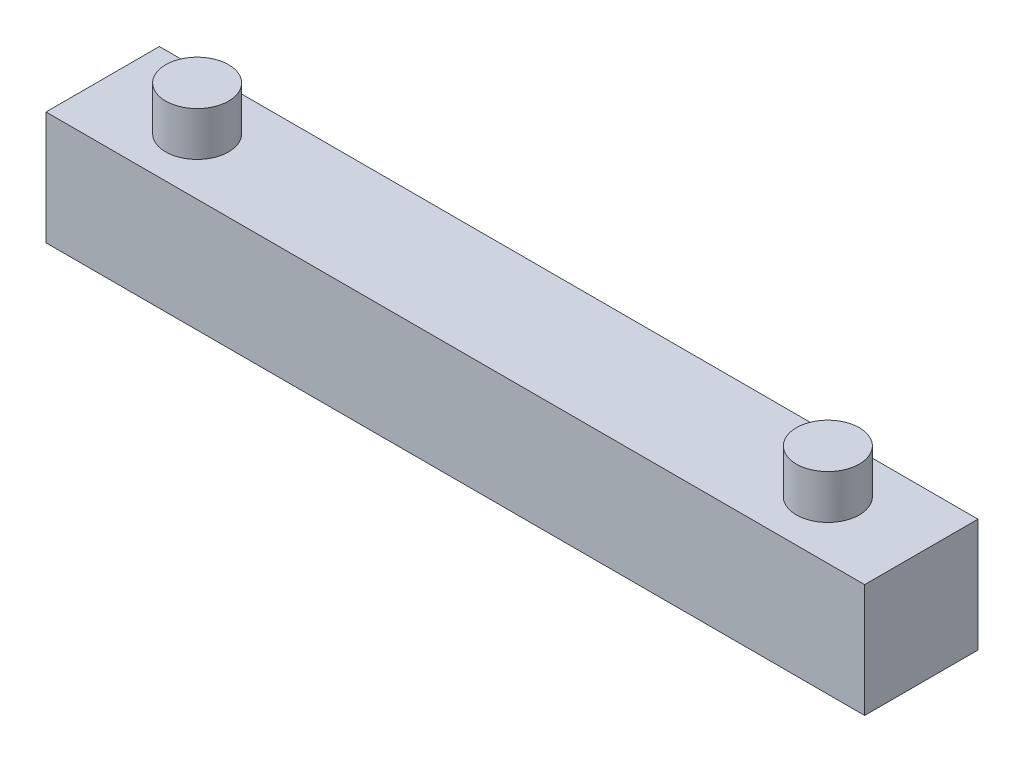
ISO-10303-21;
HEADER;
FILE_DESCRIPTION(('STEP AP214'),'2;1');
FILE_NAME('part.step','',(''),(''),'','','');
FILE_SCHEMA(('AUTOMOTIVE_DESIGN { 1 0 10303 214 1 1 1 1 }'));
ENDSEC;
DATA;
#1=APPLICATION_CONTEXT('core data for automotive mechanical design processes');
#2=APPLICATION_PROTOCOL_DEFINITION('international standard','automotive_design',2000,#1);
#3=PRODUCT_CONTEXT('',#1,'mechanical');
#4=PRODUCT('Part','Part','',(#3));
#5=PRODUCT_RELATED_PRODUCT_CATEGORY('part','',(#4));
#6=PRODUCT_DEFINITION_FORMATION('','',#4);
#7=PRODUCT_DEFINITION_CONTEXT('part definition',#1,'design');
#8=PRODUCT_DEFINITION('design','',#6,#7);
#9=PRODUCT_DEFINITION_SHAPE('','',#8);
#10=(LENGTH_UNIT() NAMED_UNIT(*) SI_UNIT(.MILLI.,.METRE.));
#11=(NAMED_UNIT(*) PLANE_ANGLE_UNIT() SI_UNIT($,.RADIAN.));
#12=(NAMED_UNIT(*) SI_UNIT($,.STERADIAN.) SOLID_ANGLE_UNIT());
#13=UNCERTAINTY_MEASURE_WITH_UNIT(LENGTH_MEASURE(1.E-05),#10,'distance_accuracy_value','');
#14=(GEOMETRIC_REPRESENTATION_CONTEXT(3) GLOBAL_UNCERTAINTY_ASSIGNED_CONTEXT((#13)) GLOBAL_UNIT_ASSIGNED_CONTEXT((#10,
#11,#12)) REPRESENTATION_CONTEXT('',''));
#15=CARTESIAN_POINT('',(0.,0.,0.));
#16=DIRECTION('',(0.,0.,1.));
#17=DIRECTION('',(1.,0.,0.));
#18=AXIS2_PLACEMENT_3D('',#15,#16,#17);
#19=CARTESIAN_POINT('',(65.,9.,9.));
#20=DIRECTION('',(0.,-1.,0.));
#21=DIRECTION('',(1.,0.,0.));
#22=AXIS2_PLACEMENT_3D('',#19,#20,#21);
#23=PLANE('',#22);
#24=CARTESIAN_POINT('',(7.50046216806165,8.99999999999999,4.5));
#25=DIRECTION('',(0.,-1.,0.));
#26=DIRECTION('',(1.,0.,0.));
#27=AXIS2_PLACEMENT_3D('',#24,#25,#26);
#28=CIRCLE('',#27,2.5);
#29=CARTESIAN_POINT('',(10.0004621680616,8.99999999999999,4.5));
#30=VERTEX_POINT('',#29);
#31=EDGE_CURVE('E42',#30,#30,#28,.F.);
#32=ORIENTED_EDGE('',*,*,#31,.F.);
#33=EDGE_LOOP('',(#32));
#34=FACE_BOUND('',#33,.T.);
#35=DIRECTION('',(-1.,0.,0.));
#36=VECTOR('',#35,1.);
#37=CARTESIAN_POINT('',(65.,9.,0.));
#38=LINE('',#37,#36);
#39=CARTESIAN_POINT('',(65.,9.,0.));
#40=VERTEX_POINT('',#39);
#41=CARTESIAN_POINT('',(0.,8.99999999999999,0.));
#42=VERTEX_POINT('',#41);
#43=EDGE_CURVE('E73',#40,#42,#38,.T.);
#44=ORIENTED_EDGE('',*,*,#43,.T.);
#45=DIRECTION('',(0.,0.,-1.));
#46=VECTOR('',#45,1.);
#47=CARTESIAN_POINT('',(0.,8.99999999999999,9.));
#48=LINE('',#47,#46);
#49=CARTESIAN_POINT('',(0.,8.99999999999999,9.));
#50=VERTEX_POINT('',#49);
#51=EDGE_CURVE('E97',#50,#42,#48,.T.);
#52=ORIENTED_EDGE('',*,*,#51,.F.);
#53=DIRECTION('',(-1.,0.,0.));
#54=VECTOR('',#53,1.);
#55=CARTESIAN_POINT('',(65.,9.,9.));
#56=LINE('',#55,#54);
#57=CARTESIAN_POINT('',(65.,9.,9.));
#58=VERTEX_POINT('',#57);
#59=EDGE_CURVE('E50',#58,#50,#56,.T.);
#60=ORIENTED_EDGE('',*,*,#59,.F.);
#61=DIRECTION('',(0.,0.,-1.));
#62=VECTOR('',#61,1.);
#63=CARTESIAN_POINT('',(65.,9.,9.));
#64=LINE('',#63,#62);
#65=EDGE_CURVE('E93',#58,#40,#64,.T.);
#66=ORIENTED_EDGE('',*,*,#65,.T.);
#67=EDGE_LOOP('',(#44,#52,#60,#66));
#68=FACE_BOUND('',#67,.T.);
#69=CARTESIAN_POINT('',(57.5004018866439,9.,4.42235891458119));
#70=DIRECTION('',(0.,-1.,0.));
#71=DIRECTION('',(1.,0.,0.));
#72=AXIS2_PLACEMENT_3D('',#69,#70,#71);
#73=CIRCLE('',#72,2.5);
#74=CARTESIAN_POINT('',(60.0004018866439,9.,4.42235891458119));
#75=VERTEX_POINT('',#74);
#76=EDGE_CURVE('E11',#75,#75,#73,.F.);
#77=ORIENTED_EDGE('',*,*,#76,.F.);
#78=EDGE_LOOP('',(#77));
#79=FACE_BOUND('',#78,.T.);
#80=ADVANCED_FACE('F33',(#34,#68,#79),#23,.F.);
#81=CARTESIAN_POINT('',(0.,8.99999999999999,9.));
#82=DIRECTION('',(1.,0.,0.));
#83=DIRECTION('',(0.,0.,-1.));
#84=AXIS2_PLACEMENT_3D('',#81,#82,#83);
#85=PLANE('',#84);
#86=DIRECTION('',(0.,-1.,0.));
#87=VECTOR('',#86,1.);
#88=CARTESIAN_POINT('',(0.,8.99999999999999,0.));
#89=LINE('',#88,#87);
#90=CARTESIAN_POINT('',(0.,0.,0.));
#91=VERTEX_POINT('',#90);
#92=EDGE_CURVE('E101',#42,#91,#89,.T.);
#93=ORIENTED_EDGE('',*,*,#92,.T.);
#94=DIRECTION('',(0.,0.,-1.));
#95=VECTOR('',#94,1.);
#96=CARTESIAN_POINT('',(0.,0.,9.));
#97=LINE('',#96,#95);
#98=CARTESIAN_POINT('',(0.,0.,9.));
#99=VERTEX_POINT('',#98);
#100=EDGE_CURVE('E92',#99,#91,#97,.T.);
#101=ORIENTED_EDGE('',*,*,#100,.F.);
#102=DIRECTION('',(0.,-1.,0.));
#103=VECTOR('',#102,1.);
#104=CARTESIAN_POINT('',(0.,8.99999999999999,9.));
#105=LINE('',#104,#103);
#106=EDGE_CURVE('E86',#50,#99,#105,.T.);
#107=ORIENTED_EDGE('',*,*,#106,.F.);
#108=ORIENTED_EDGE('',*,*,#51,.T.);
#109=EDGE_LOOP('',(#93,#101,#107,#108));
#110=FACE_BOUND('',#109,.T.);
#111=ADVANCED_FACE('F35',(#110),#85,.F.);
#112=CARTESIAN_POINT('',(0.,0.,9.));
#113=DIRECTION('',(0.,1.,0.));
#114=DIRECTION('',(0.,0.,1.));
#115=AXIS2_PLACEMENT_3D('',#112,#113,#114);
#116=PLANE('',#115);
#117=DIRECTION('',(1.,0.,0.));
#118=VECTOR('',#117,1.);
#119=CARTESIAN_POINT('',(0.,0.,0.));
#120=LINE('',#119,#118);
#121=CARTESIAN_POINT('',(65.,0.,0.));
#122=VERTEX_POINT('',#121);
#123=EDGE_CURVE('E91',#91,#122,#120,.T.);
#124=ORIENTED_EDGE('',*,*,#123,.T.);
#125=DIRECTION('',(0.,0.,-1.));
#126=VECTOR('',#125,1.);
#127=CARTESIAN_POINT('',(65.,0.,9.));
#128=LINE('',#127,#126);
#129=CARTESIAN_POINT('',(65.,0.,9.));
#130=VERTEX_POINT('',#129);
#131=EDGE_CURVE('E89',#130,#122,#128,.T.);
#132=ORIENTED_EDGE('',*,*,#131,.F.);
#133=DIRECTION('',(1.,0.,0.));
#134=VECTOR('',#133,1.);
#135=CARTESIAN_POINT('',(0.,0.,9.));
#136=LINE('',#135,#134);
#137=EDGE_CURVE('E81',#99,#130,#136,.T.);
#138=ORIENTED_EDGE('',*,*,#137,.F.);
#139=ORIENTED_EDGE('',*,*,#100,.T.);
#140=EDGE_LOOP('',(#124,#132,#138,#139));
#141=FACE_BOUND('',#140,.T.);
#142=ADVANCED_FACE('F90',(#141),#116,.F.);
#143=CARTESIAN_POINT('',(65.,0.,9.));
#144=DIRECTION('',(-1.,0.,0.));
#145=DIRECTION('',(0.,0.,1.));
#146=AXIS2_PLACEMENT_3D('',#143,#144,#145);
#147=PLANE('',#146);
#148=DIRECTION('',(0.,1.,0.));
#149=VECTOR('',#148,1.);
#150=CARTESIAN_POINT('',(65.,0.,0.));
#151=LINE('',#150,#149);
#152=EDGE_CURVE('E67',#122,#40,#151,.T.);
#153=ORIENTED_EDGE('',*,*,#152,.T.);
#154=ORIENTED_EDGE('',*,*,#65,.F.);
#155=DIRECTION('',(0.,1.,0.));
#156=VECTOR('',#155,1.);
#157=CARTESIAN_POINT('',(65.,0.,9.));
#158=LINE('',#157,#156);
#159=EDGE_CURVE('E84',#130,#58,#158,.T.);
#160=ORIENTED_EDGE('',*,*,#159,.F.);
#161=ORIENTED_EDGE('',*,*,#131,.T.);
#162=EDGE_LOOP('',(#153,#154,#160,#161));
#163=FACE_BOUND('',#162,.T.);
#164=ADVANCED_FACE('F95',(#163),#147,.F.);
#165=CARTESIAN_POINT('',(0.,0.,9.));
#166=DIRECTION('',(0.,0.,1.));
#167=DIRECTION('',(1.,0.,0.));
#168=AXIS2_PLACEMENT_3D('',#165,#166,#167);
#169=PLANE('',#168);
#170=ORIENTED_EDGE('',*,*,#106,.T.);
#171=ORIENTED_EDGE('',*,*,#137,.T.);
#172=ORIENTED_EDGE('',*,*,#159,.T.);
#173=ORIENTED_EDGE('',*,*,#59,.T.);
#174=EDGE_LOOP('',(#170,#171,#172,#173));
#175=FACE_BOUND('',#174,.T.);
#176=ADVANCED_FACE('F82',(#175),#169,.T.);
#177=CARTESIAN_POINT('',(0.,0.,0.));
#178=DIRECTION('',(0.,0.,1.));
#179=DIRECTION('',(1.,0.,0.));
#180=AXIS2_PLACEMENT_3D('',#177,#178,#179);
#181=PLANE('',#180);
#182=ORIENTED_EDGE('',*,*,#92,.F.);
#183=ORIENTED_EDGE('',*,*,#43,.F.);
#184=ORIENTED_EDGE('',*,*,#152,.F.);
#185=ORIENTED_EDGE('',*,*,#123,.F.);
#186=EDGE_LOOP('',(#182,#183,#184,#185));
#187=FACE_BOUND('',#186,.T.);
#188=ADVANCED_FACE('F138',(#187),#181,.F.);
#189=CARTESIAN_POINT('',(7.50046216806165,12.5,4.5));
#190=DIRECTION('',(0.,-1.,0.));
#191=DIRECTION('',(1.,0.,0.));
#192=AXIS2_PLACEMENT_3D('',#189,#190,#191);
#193=CYLINDRICAL_SURFACE('',#192,2.5);
#194=CARTESIAN_POINT('',(7.50046216806165,12.5,4.5));
#195=DIRECTION('',(0.,1.,0.));
#196=DIRECTION('',(-1.,0.,0.));
#197=AXIS2_PLACEMENT_3D('',#194,#195,#196);
#198=CIRCLE('',#197,2.5);
#199=CARTESIAN_POINT('',(5.00046216806165,12.5,4.5));
#200=VERTEX_POINT('',#199);
#201=EDGE_CURVE('E104',#200,#200,#198,.T.);
#202=ORIENTED_EDGE('',*,*,#201,.F.);
#203=EDGE_LOOP('',(#202));
#204=FACE_BOUND('',#203,.T.);
#205=ORIENTED_EDGE('',*,*,#31,.T.);
#206=EDGE_LOOP('',(#205));
#207=FACE_BOUND('',#206,.T.);
#208=ADVANCED_FACE('F113',(#204,#207),#193,.T.);
#209=CARTESIAN_POINT('',(7.50046216806165,12.5,4.5));
#210=DIRECTION('',(0.,1.,0.));
#211=DIRECTION('',(-1.,0.,0.));
#212=AXIS2_PLACEMENT_3D('',#209,#210,#211);
#213=PLANE('',#212);
#214=ORIENTED_EDGE('',*,*,#201,.T.);
#215=EDGE_LOOP('',(#214));
#216=FACE_BOUND('',#215,.T.);
#217=ADVANCED_FACE('F123',(#216),#213,.T.);
#218=CARTESIAN_POINT('',(57.5004018866439,12.5,4.42235891458119));
#219=DIRECTION('',(0.,-1.,0.));
#220=DIRECTION('',(1.,0.,0.));
#221=AXIS2_PLACEMENT_3D('',#218,#219,#220);
#222=CYLINDRICAL_SURFACE('',#221,2.5);
#223=CARTESIAN_POINT('',(57.5004018866439,12.5,4.42235891458119));
#224=DIRECTION('',(0.,1.,0.));
#225=DIRECTION('',(-1.,0.,0.));
#226=AXIS2_PLACEMENT_3D('',#223,#224,#225);
#227=CIRCLE('',#226,2.5);
#228=CARTESIAN_POINT('',(55.0004018866439,12.5,4.42235891458119));
#229=VERTEX_POINT('',#228);
#230=EDGE_CURVE('E157',#229,#229,#227,.T.);
#231=ORIENTED_EDGE('',*,*,#230,.F.);
#232=EDGE_LOOP('',(#231));
#233=FACE_BOUND('',#232,.T.);
#234=ORIENTED_EDGE('',*,*,#76,.T.);
#235=EDGE_LOOP('',(#234));
#236=FACE_BOUND('',#235,.T.);
#237=ADVANCED_FACE('F120',(#233,#236),#222,.T.);
#238=CARTESIAN_POINT('',(57.5004018866439,12.5,4.42235891458119));
#239=DIRECTION('',(0.,1.,0.));
#240=DIRECTION('',(-1.,0.,0.));
#241=AXIS2_PLACEMENT_3D('',#238,#239,#240);
#242=PLANE('',#241);
#243=ORIENTED_EDGE('',*,*,#230,.T.);
#244=EDGE_LOOP('',(#243));
#245=FACE_BOUND('',#244,.T.);
#246=ADVANCED_FACE('F122',(#245),#242,.T.);
#247=CLOSED_SHELL('',(#80,#111,#142,#164,#176,#188,#208,#217,#237,#246));
#248=MANIFOLD_SOLID_BREP('B2',#247);
#249=ADVANCED_BREP_SHAPE_REPRESENTATION('',(#18,#248),#14);
#250=SHAPE_DEFINITION_REPRESENTATION(#9,#249);
ENDSEC;
END-ISO-10303-21;
